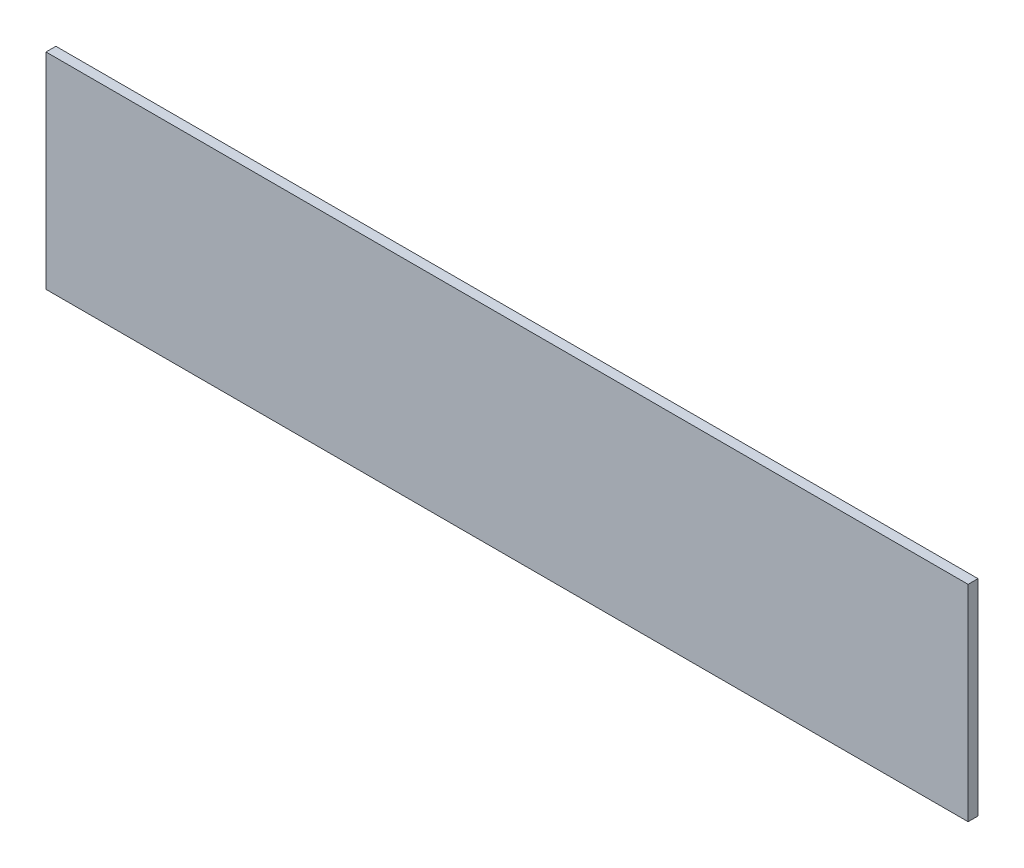
ISO-10303-21;
HEADER;
FILE_DESCRIPTION(('STEP AP214'),'2;1');
FILE_NAME('part.step','',(''),(''),'','','');
FILE_SCHEMA(('AUTOMOTIVE_DESIGN { 1 0 10303 214 1 1 1 1 }'));
ENDSEC;
DATA;
#1=APPLICATION_CONTEXT('core data for automotive mechanical design processes');
#2=APPLICATION_PROTOCOL_DEFINITION('international standard','automotive_design',2000,#1);
#3=PRODUCT_CONTEXT('',#1,'mechanical');
#4=PRODUCT('Part','Part','',(#3));
#5=PRODUCT_RELATED_PRODUCT_CATEGORY('part','',(#4));
#6=PRODUCT_DEFINITION_FORMATION('','',#4);
#7=PRODUCT_DEFINITION_CONTEXT('part definition',#1,'design');
#8=PRODUCT_DEFINITION('design','',#6,#7);
#9=PRODUCT_DEFINITION_SHAPE('','',#8);
#10=(LENGTH_UNIT() NAMED_UNIT(*) SI_UNIT(.MILLI.,.METRE.));
#11=(NAMED_UNIT(*) PLANE_ANGLE_UNIT() SI_UNIT($,.RADIAN.));
#12=(NAMED_UNIT(*) SI_UNIT($,.STERADIAN.) SOLID_ANGLE_UNIT());
#13=UNCERTAINTY_MEASURE_WITH_UNIT(LENGTH_MEASURE(1.E-05),#10,'distance_accuracy_value','');
#14=(GEOMETRIC_REPRESENTATION_CONTEXT(3) GLOBAL_UNCERTAINTY_ASSIGNED_CONTEXT((#13)) GLOBAL_UNIT_ASSIGNED_CONTEXT((#10,
#11,#12)) REPRESENTATION_CONTEXT('',''));
#15=CARTESIAN_POINT('',(0.,0.,0.));
#16=DIRECTION('',(0.,0.,1.));
#17=DIRECTION('',(1.,0.,0.));
#18=AXIS2_PLACEMENT_3D('',#15,#16,#17);
#19=CARTESIAN_POINT('',(0.,0.,6.35));
#20=DIRECTION('',(1.,0.,0.));
#21=DIRECTION('',(0.,0.,-1.));
#22=AXIS2_PLACEMENT_3D('',#19,#20,#21);
#23=PLANE('',#22);
#24=DIRECTION('',(0.,-1.,0.));
#25=VECTOR('',#24,1.);
#26=CARTESIAN_POINT('',(0.,0.,0.));
#27=LINE('',#26,#25);
#28=CARTESIAN_POINT('',(0.,132.,0.));
#29=VERTEX_POINT('',#28);
#30=CARTESIAN_POINT('',(0.,0.,0.));
#31=VERTEX_POINT('',#30);
#32=EDGE_CURVE('E96',#29,#31,#27,.T.);
#33=ORIENTED_EDGE('',*,*,#32,.T.);
#34=DIRECTION('',(0.,0.,-1.));
#35=VECTOR('',#34,1.);
#36=CARTESIAN_POINT('',(0.,0.,6.35));
#37=LINE('',#36,#35);
#38=CARTESIAN_POINT('',(0.,0.,6.35));
#39=VERTEX_POINT('',#38);
#40=EDGE_CURVE('E11',#39,#31,#37,.T.);
#41=ORIENTED_EDGE('',*,*,#40,.F.);
#42=DIRECTION('',(0.,-1.,0.));
#43=VECTOR('',#42,1.);
#44=CARTESIAN_POINT('',(0.,0.,6.35));
#45=LINE('',#44,#43);
#46=CARTESIAN_POINT('',(0.,132.,6.35));
#47=VERTEX_POINT('',#46);
#48=EDGE_CURVE('E84',#47,#39,#45,.T.);
#49=ORIENTED_EDGE('',*,*,#48,.F.);
#50=DIRECTION('',(0.,0.,-1.));
#51=VECTOR('',#50,1.);
#52=CARTESIAN_POINT('',(0.,132.,6.35));
#53=LINE('',#52,#51);
#54=EDGE_CURVE('E92',#47,#29,#53,.T.);
#55=ORIENTED_EDGE('',*,*,#54,.T.);
#56=EDGE_LOOP('',(#33,#41,#49,#55));
#57=FACE_BOUND('',#56,.T.);
#58=ADVANCED_FACE('F33',(#57),#23,.F.);
#59=CARTESIAN_POINT('',(0.,0.,6.35));
#60=DIRECTION('',(0.,1.,0.));
#61=DIRECTION('',(0.,0.,1.));
#62=AXIS2_PLACEMENT_3D('',#59,#60,#61);
#63=PLANE('',#62);
#64=DIRECTION('',(1.,0.,0.));
#65=VECTOR('',#64,1.);
#66=CARTESIAN_POINT('',(0.,0.,0.));
#67=LINE('',#66,#65);
#68=CARTESIAN_POINT('',(592.,0.,0.));
#69=VERTEX_POINT('',#68);
#70=EDGE_CURVE('E88',#31,#69,#67,.T.);
#71=ORIENTED_EDGE('',*,*,#70,.T.);
#72=DIRECTION('',(0.,0.,-1.));
#73=VECTOR('',#72,1.);
#74=CARTESIAN_POINT('',(592.,0.,6.35));
#75=LINE('',#74,#73);
#76=CARTESIAN_POINT('',(592.,0.,6.35));
#77=VERTEX_POINT('',#76);
#78=EDGE_CURVE('E41',#77,#69,#75,.T.);
#79=ORIENTED_EDGE('',*,*,#78,.F.);
#80=DIRECTION('',(1.,0.,0.));
#81=VECTOR('',#80,1.);
#82=CARTESIAN_POINT('',(0.,0.,6.35));
#83=LINE('',#82,#81);
#84=EDGE_CURVE('E79',#39,#77,#83,.T.);
#85=ORIENTED_EDGE('',*,*,#84,.F.);
#86=ORIENTED_EDGE('',*,*,#40,.T.);
#87=EDGE_LOOP('',(#71,#79,#85,#86));
#88=FACE_BOUND('',#87,.T.);
#89=ADVANCED_FACE('F87',(#88),#63,.F.);
#90=CARTESIAN_POINT('',(592.,0.,6.35));
#91=DIRECTION('',(-1.,0.,0.));
#92=DIRECTION('',(0.,0.,1.));
#93=AXIS2_PLACEMENT_3D('',#90,#91,#92);
#94=PLANE('',#93);
#95=DIRECTION('',(0.,1.,0.));
#96=VECTOR('',#95,1.);
#97=CARTESIAN_POINT('',(592.,0.,0.));
#98=LINE('',#97,#96);
#99=CARTESIAN_POINT('',(592.,132.,0.));
#100=VERTEX_POINT('',#99);
#101=EDGE_CURVE('E66',#69,#100,#98,.T.);
#102=ORIENTED_EDGE('',*,*,#101,.T.);
#103=DIRECTION('',(0.,0.,-1.));
#104=VECTOR('',#103,1.);
#105=CARTESIAN_POINT('',(592.,132.,6.35));
#106=LINE('',#105,#104);
#107=CARTESIAN_POINT('',(592.,132.,6.35));
#108=VERTEX_POINT('',#107);
#109=EDGE_CURVE('E89',#108,#100,#106,.T.);
#110=ORIENTED_EDGE('',*,*,#109,.F.);
#111=DIRECTION('',(0.,1.,0.));
#112=VECTOR('',#111,1.);
#113=CARTESIAN_POINT('',(592.,0.,6.35));
#114=LINE('',#113,#112);
#115=EDGE_CURVE('E82',#77,#108,#114,.T.);
#116=ORIENTED_EDGE('',*,*,#115,.F.);
#117=ORIENTED_EDGE('',*,*,#78,.T.);
#118=EDGE_LOOP('',(#102,#110,#116,#117));
#119=FACE_BOUND('',#118,.T.);
#120=ADVANCED_FACE('F90',(#119),#94,.F.);
#121=CARTESIAN_POINT('',(0.,132.,6.35));
#122=DIRECTION('',(0.,-1.,0.));
#123=DIRECTION('',(0.,0.,-1.));
#124=AXIS2_PLACEMENT_3D('',#121,#122,#123);
#125=PLANE('',#124);
#126=DIRECTION('',(-1.,0.,0.));
#127=VECTOR('',#126,1.);
#128=CARTESIAN_POINT('',(0.,132.,0.));
#129=LINE('',#128,#127);
#130=EDGE_CURVE('E72',#100,#29,#129,.T.);
#131=ORIENTED_EDGE('',*,*,#130,.T.);
#132=ORIENTED_EDGE('',*,*,#54,.F.);
#133=DIRECTION('',(-1.,0.,0.));
#134=VECTOR('',#133,1.);
#135=CARTESIAN_POINT('',(0.,132.,6.35));
#136=LINE('',#135,#134);
#137=EDGE_CURVE('E49',#108,#47,#136,.T.);
#138=ORIENTED_EDGE('',*,*,#137,.F.);
#139=ORIENTED_EDGE('',*,*,#109,.T.);
#140=EDGE_LOOP('',(#131,#132,#138,#139));
#141=FACE_BOUND('',#140,.T.);
#142=ADVANCED_FACE('F103',(#141),#125,.F.);
#143=CARTESIAN_POINT('',(0.,0.,6.35));
#144=DIRECTION('',(0.,0.,-1.));
#145=DIRECTION('',(-1.,0.,0.));
#146=AXIS2_PLACEMENT_3D('',#143,#144,#145);
#147=PLANE('',#146);
#148=ORIENTED_EDGE('',*,*,#48,.T.);
#149=ORIENTED_EDGE('',*,*,#84,.T.);
#150=ORIENTED_EDGE('',*,*,#115,.T.);
#151=ORIENTED_EDGE('',*,*,#137,.T.);
#152=EDGE_LOOP('',(#148,#149,#150,#151));
#153=FACE_BOUND('',#152,.T.);
#154=ADVANCED_FACE('F80',(#153),#147,.F.);
#155=CARTESIAN_POINT('',(0.,0.,0.));
#156=DIRECTION('',(0.,0.,-1.));
#157=DIRECTION('',(-1.,0.,0.));
#158=AXIS2_PLACEMENT_3D('',#155,#156,#157);
#159=PLANE('',#158);
#160=ORIENTED_EDGE('',*,*,#32,.F.);
#161=ORIENTED_EDGE('',*,*,#130,.F.);
#162=ORIENTED_EDGE('',*,*,#101,.F.);
#163=ORIENTED_EDGE('',*,*,#70,.F.);
#164=EDGE_LOOP('',(#160,#161,#162,#163));
#165=FACE_BOUND('',#164,.T.);
#166=ADVANCED_FACE('F106',(#165),#159,.T.);
#167=CLOSED_SHELL('',(#58,#89,#120,#142,#154,#166));
#168=MANIFOLD_SOLID_BREP('B2',#167);
#169=ADVANCED_BREP_SHAPE_REPRESENTATION('',(#18,#168),#14);
#170=SHAPE_DEFINITION_REPRESENTATION(#9,#169);
ENDSEC;
END-ISO-10303-21;
